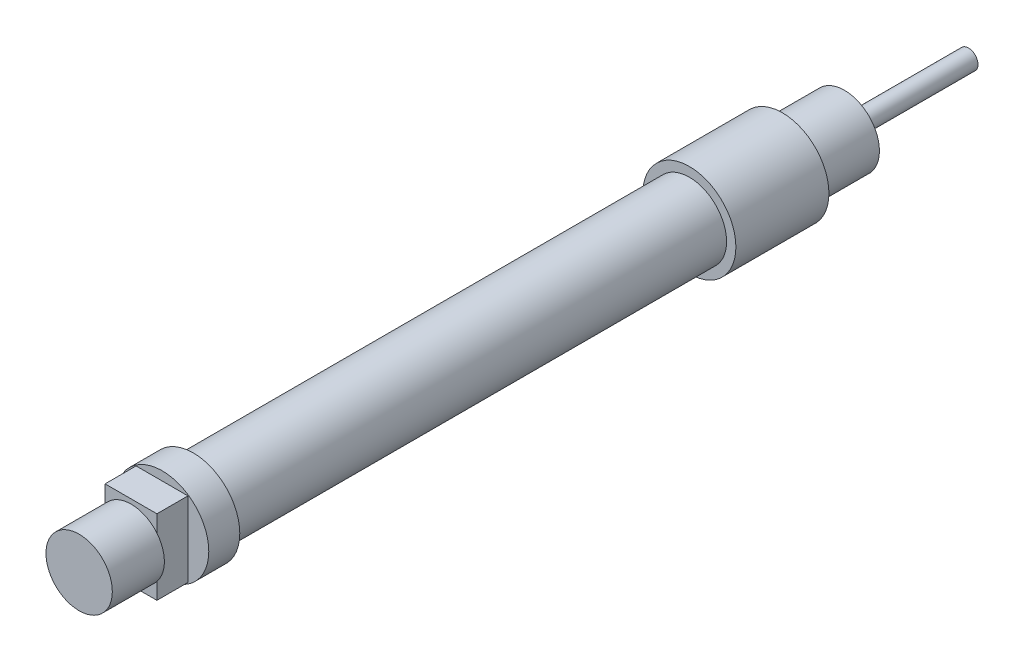
ISO-10303-21;
HEADER;
FILE_DESCRIPTION(('STEP AP214'),'2;1');
FILE_NAME('part.step','',(''),(''),'','','');
FILE_SCHEMA(('AUTOMOTIVE_DESIGN { 1 0 10303 214 1 1 1 1 }'));
ENDSEC;
DATA;
#1=APPLICATION_CONTEXT('core data for automotive mechanical design processes');
#2=APPLICATION_PROTOCOL_DEFINITION('international standard','automotive_design',2000,#1);
#3=PRODUCT_CONTEXT('',#1,'mechanical');
#4=PRODUCT('Part','Part','',(#3));
#5=PRODUCT_RELATED_PRODUCT_CATEGORY('part','',(#4));
#6=PRODUCT_DEFINITION_FORMATION('','',#4);
#7=PRODUCT_DEFINITION_CONTEXT('part definition',#1,'design');
#8=PRODUCT_DEFINITION('design','',#6,#7);
#9=PRODUCT_DEFINITION_SHAPE('','',#8);
#10=(LENGTH_UNIT() NAMED_UNIT(*) SI_UNIT(.MILLI.,.METRE.));
#11=(NAMED_UNIT(*) PLANE_ANGLE_UNIT() SI_UNIT($,.RADIAN.));
#12=(NAMED_UNIT(*) SI_UNIT($,.STERADIAN.) SOLID_ANGLE_UNIT());
#13=UNCERTAINTY_MEASURE_WITH_UNIT(LENGTH_MEASURE(1.E-05),#10,'distance_accuracy_value','');
#14=(GEOMETRIC_REPRESENTATION_CONTEXT(3) GLOBAL_UNCERTAINTY_ASSIGNED_CONTEXT((#13)) GLOBAL_UNIT_ASSIGNED_CONTEXT((#10,
#11,#12)) REPRESENTATION_CONTEXT('',''));
#15=CARTESIAN_POINT('',(0.,0.,0.));
#16=DIRECTION('',(0.,0.,1.));
#17=DIRECTION('',(1.,0.,0.));
#18=AXIS2_PLACEMENT_3D('',#15,#16,#17);
#19=CARTESIAN_POINT('',(-11.6702591087851,4.99038929440389,-10.));
#20=DIRECTION('',(0.,0.,-1.));
#21=DIRECTION('',(-1.,0.,0.));
#22=AXIS2_PLACEMENT_3D('',#19,#20,#21);
#23=PLANE('',#22);
#24=CARTESIAN_POINT('',(-11.6702591087851,4.99038929440389,-10.));
#25=DIRECTION('',(0.,0.,-1.));
#26=DIRECTION('',(-1.,0.,0.));
#27=AXIS2_PLACEMENT_3D('',#24,#25,#26);
#28=CIRCLE('',#27,5.64119912382956);
#29=CARTESIAN_POINT('',(-17.3114582326147,4.99038929440389,-10.));
#30=VERTEX_POINT('',#29);
#31=EDGE_CURVE('E112',#30,#30,#28,.T.);
#32=ORIENTED_EDGE('',*,*,#31,.T.);
#33=EDGE_LOOP('',(#32));
#34=FACE_BOUND('',#33,.T.);
#35=CARTESIAN_POINT('',(-11.6702591087851,4.99038929440389,-10.));
#36=DIRECTION('',(0.,0.,-1.));
#37=DIRECTION('',(-1.,0.,0.));
#38=AXIS2_PLACEMENT_3D('',#35,#36,#37);
#39=CIRCLE('',#38,1.54051339526944);
#40=CARTESIAN_POINT('',(-13.2107725040546,4.99038929440389,-10.));
#41=VERTEX_POINT('',#40);
#42=EDGE_CURVE('E134',#41,#41,#39,.T.);
#43=ORIENTED_EDGE('',*,*,#42,.F.);
#44=EDGE_LOOP('',(#43));
#45=FACE_BOUND('',#44,.T.);
#46=ADVANCED_FACE('F37',(#34,#45),#23,.T.);
#47=CARTESIAN_POINT('',(-11.6702591087851,4.99038929440389,0.));
#48=DIRECTION('',(0.,0.,1.));
#49=DIRECTION('',(1.,0.,0.));
#50=AXIS2_PLACEMENT_3D('',#47,#48,#49);
#51=PLANE('',#50);
#52=CARTESIAN_POINT('',(-11.6702591087851,4.99038929440389,0.));
#53=DIRECTION('',(0.,0.,1.));
#54=DIRECTION('',(1.,0.,0.));
#55=AXIS2_PLACEMENT_3D('',#52,#53,#54);
#56=CIRCLE('',#55,7.5);
#57=CARTESIAN_POINT('',(-4.17025910878514,4.99038929440389,0.));
#58=VERTEX_POINT('',#57);
#59=EDGE_CURVE('E120',#58,#58,#56,.T.);
#60=ORIENTED_EDGE('',*,*,#59,.F.);
#61=EDGE_LOOP('',(#60));
#62=FACE_BOUND('',#61,.T.);
#63=CARTESIAN_POINT('',(-11.6702591087851,4.99038929440389,0.));
#64=DIRECTION('',(0.,0.,1.));
#65=DIRECTION('',(1.,0.,0.));
#66=AXIS2_PLACEMENT_3D('',#63,#64,#65);
#67=CIRCLE('',#66,5.64119912382956);
#68=CARTESIAN_POINT('',(-6.02905998495558,4.99038929440389,0.));
#69=VERTEX_POINT('',#68);
#70=EDGE_CURVE('E11',#69,#69,#67,.F.);
#71=ORIENTED_EDGE('',*,*,#70,.F.);
#72=EDGE_LOOP('',(#71));
#73=FACE_BOUND('',#72,.T.);
#74=ADVANCED_FACE('F150',(#62,#73),#51,.F.);
#75=CARTESIAN_POINT('',(0.,0.,105.));
#76=DIRECTION('',(0.,0.,1.));
#77=DIRECTION('',(1.,0.,0.));
#78=AXIS2_PLACEMENT_3D('',#75,#76,#77);
#79=PLANE('',#78);
#80=CARTESIAN_POINT('',(-11.6702591087851,4.99038929440389,105.));
#81=DIRECTION('',(0.,0.,1.));
#82=DIRECTION('',(1.,0.,0.));
#83=AXIS2_PLACEMENT_3D('',#80,#81,#82);
#84=CIRCLE('',#83,5.35);
#85=CARTESIAN_POINT('',(-7.51876812336915,8.36494446479447,105.));
#86=VERTEX_POINT('',#85);
#87=CARTESIAN_POINT('',(-15.8771447306678,8.29562958285441,105.));
#88=VERTEX_POINT('',#87);
#89=EDGE_CURVE('E114',#86,#88,#84,.T.);
#90=ORIENTED_EDGE('',*,*,#89,.F.);
#91=DIRECTION('',(0.,1.,0.));
#92=VECTOR('',#91,1.);
#93=CARTESIAN_POINT('',(-7.51876812336915,-1.02325652339945,105.));
#94=LINE('',#93,#92);
#95=CARTESIAN_POINT('',(-7.51876812336915,11.0668397408952,105.));
#96=VERTEX_POINT('',#95);
#97=EDGE_CURVE('E99',#86,#96,#94,.T.);
#98=ORIENTED_EDGE('',*,*,#97,.T.);
#99=DIRECTION('',(-1.,0.,0.));
#100=VECTOR('',#99,1.);
#101=CARTESIAN_POINT('',(-7.51876812336915,11.0668397408952,105.));
#102=LINE('',#101,#100);
#103=CARTESIAN_POINT('',(-15.8771447306679,11.0668397408952,105.));
#104=VERTEX_POINT('',#103);
#105=EDGE_CURVE('E96',#96,#104,#102,.T.);
#106=ORIENTED_EDGE('',*,*,#105,.T.);
#107=DIRECTION('',(0.,-1.,0.));
#108=VECTOR('',#107,1.);
#109=CARTESIAN_POINT('',(-15.8771447306679,11.0668397408952,105.));
#110=LINE('',#109,#108);
#111=EDGE_CURVE('E250',#104,#88,#110,.T.);
#112=ORIENTED_EDGE('',*,*,#111,.T.);
#113=EDGE_LOOP('',(#90,#98,#106,#112));
#114=FACE_BOUND('',#113,.T.);
#115=ADVANCED_FACE('F156',(#114),#79,.T.);
#116=CARTESIAN_POINT('',(-11.6581113080212,5.00253709516818,100.));
#117=DIRECTION('',(0.,0.,1.));
#118=DIRECTION('',(1.,0.,0.));
#119=AXIS2_PLACEMENT_3D('',#116,#117,#118);
#120=PLANE('',#119);
#121=CARTESIAN_POINT('',(-11.6581113080212,5.00253709516818,100.));
#122=DIRECTION('',(0.,0.,1.));
#123=DIRECTION('',(1.,0.,0.));
#124=AXIS2_PLACEMENT_3D('',#121,#122,#123);
#125=CIRCLE('',#124,7.5);
#126=CARTESIAN_POINT('',(-4.15811130802117,5.00253709516818,100.));
#127=VERTEX_POINT('',#126);
#128=EDGE_CURVE('E217',#127,#127,#125,.T.);
#129=ORIENTED_EDGE('',*,*,#128,.T.);
#130=EDGE_LOOP('',(#129));
#131=FACE_BOUND('',#130,.T.);
#132=DIRECTION('',(-1.,0.,0.));
#133=VECTOR('',#132,1.);
#134=CARTESIAN_POINT('',(-7.51876812336915,11.0668397408952,100.));
#135=LINE('',#134,#133);
#136=CARTESIAN_POINT('',(-7.51876812336915,11.0668397408952,100.));
#137=VERTEX_POINT('',#136);
#138=CARTESIAN_POINT('',(-15.8771447306679,11.0668397408952,100.));
#139=VERTEX_POINT('',#138);
#140=EDGE_CURVE('E128',#137,#139,#135,.T.);
#141=ORIENTED_EDGE('',*,*,#140,.F.);
#142=DIRECTION('',(0.,1.,0.));
#143=VECTOR('',#142,1.);
#144=CARTESIAN_POINT('',(-7.51876812336915,4.99038929440389,100.));
#145=LINE('',#144,#143);
#146=CARTESIAN_POINT('',(-7.51876812336915,-1.02325652339945,100.));
#147=VERTEX_POINT('',#146);
#148=EDGE_CURVE('E125',#147,#137,#145,.T.);
#149=ORIENTED_EDGE('',*,*,#148,.F.);
#150=DIRECTION('',(1.,0.,0.));
#151=VECTOR('',#150,1.);
#152=CARTESIAN_POINT('',(-15.8771447306679,-1.02325652339945,100.));
#153=LINE('',#152,#151);
#154=CARTESIAN_POINT('',(-15.8771447306679,-1.02325652339945,100.));
#155=VERTEX_POINT('',#154);
#156=EDGE_CURVE('E243',#155,#147,#153,.T.);
#157=ORIENTED_EDGE('',*,*,#156,.F.);
#158=DIRECTION('',(0.,-1.,0.));
#159=VECTOR('',#158,1.);
#160=CARTESIAN_POINT('',(-15.8771447306679,11.0668397408952,100.));
#161=LINE('',#160,#159);
#162=EDGE_CURVE('E245',#139,#155,#161,.T.);
#163=ORIENTED_EDGE('',*,*,#162,.F.);
#164=EDGE_LOOP('',(#141,#149,#157,#163));
#165=FACE_BOUND('',#164,.T.);
#166=ADVANCED_FACE('F188',(#131,#165),#120,.T.);
#167=CARTESIAN_POINT('',(-11.6702591087851,4.99038929440389,15.));
#168=DIRECTION('',(0.,0.,1.));
#169=DIRECTION('',(1.,0.,0.));
#170=AXIS2_PLACEMENT_3D('',#167,#168,#169);
#171=PLANE('',#170);
#172=CARTESIAN_POINT('',(-11.6702591087851,4.99038929440389,15.));
#173=DIRECTION('',(0.,0.,1.));
#174=DIRECTION('',(1.,0.,0.));
#175=AXIS2_PLACEMENT_3D('',#172,#173,#174);
#176=CIRCLE('',#175,7.5);
#177=CARTESIAN_POINT('',(-4.17025910878514,4.99038929440389,15.));
#178=VERTEX_POINT('',#177);
#179=EDGE_CURVE('E118',#178,#178,#176,.T.);
#180=ORIENTED_EDGE('',*,*,#179,.T.);
#181=EDGE_LOOP('',(#180));
#182=FACE_BOUND('',#181,.T.);
#183=CARTESIAN_POINT('',(-11.6702591087851,4.99038929440389,15.));
#184=DIRECTION('',(0.,0.,1.));
#185=DIRECTION('',(1.,0.,0.));
#186=AXIS2_PLACEMENT_3D('',#183,#184,#185);
#187=CIRCLE('',#186,6.);
#188=CARTESIAN_POINT('',(-5.67025910878514,4.99038929440389,15.));
#189=VERTEX_POINT('',#188);
#190=EDGE_CURVE('E214',#189,#189,#187,.T.);
#191=ORIENTED_EDGE('',*,*,#190,.F.);
#192=EDGE_LOOP('',(#191));
#193=FACE_BOUND('',#192,.T.);
#194=ADVANCED_FACE('F191',(#182,#193),#171,.T.);
#195=CARTESIAN_POINT('',(-11.6702591087851,4.99038929440389,15.));
#196=DIRECTION('',(0.,0.,-1.));
#197=DIRECTION('',(-1.,0.,0.));
#198=AXIS2_PLACEMENT_3D('',#195,#196,#197);
#199=CYLINDRICAL_SURFACE('',#198,7.5);
#200=ORIENTED_EDGE('',*,*,#179,.F.);
#201=EDGE_LOOP('',(#200));
#202=FACE_BOUND('',#201,.T.);
#203=ORIENTED_EDGE('',*,*,#59,.T.);
#204=EDGE_LOOP('',(#203));
#205=FACE_BOUND('',#204,.T.);
#206=ADVANCED_FACE('F39',(#202,#205),#199,.T.);
#207=CARTESIAN_POINT('',(-11.6702591087851,4.99038929440389,95.));
#208=DIRECTION('',(0.,0.,-1.));
#209=DIRECTION('',(-1.,0.,0.));
#210=AXIS2_PLACEMENT_3D('',#207,#208,#209);
#211=CYLINDRICAL_SURFACE('',#210,6.);
#212=CARTESIAN_POINT('',(-11.6702591087851,4.99038929440389,95.));
#213=DIRECTION('',(0.,0.,1.));
#214=DIRECTION('',(1.,0.,0.));
#215=AXIS2_PLACEMENT_3D('',#212,#213,#214);
#216=CIRCLE('',#215,6.);
#217=CARTESIAN_POINT('',(-5.67025910878514,4.99038929440389,95.));
#218=VERTEX_POINT('',#217);
#219=EDGE_CURVE('E216',#218,#218,#216,.T.);
#220=ORIENTED_EDGE('',*,*,#219,.F.);
#221=EDGE_LOOP('',(#220));
#222=FACE_BOUND('',#221,.T.);
#223=ORIENTED_EDGE('',*,*,#190,.T.);
#224=EDGE_LOOP('',(#223));
#225=FACE_BOUND('',#224,.T.);
#226=ADVANCED_FACE('F196',(#222,#225),#211,.T.);
#227=CARTESIAN_POINT('',(-11.6581113080212,5.00253709516818,95.));
#228=DIRECTION('',(0.,0.,1.));
#229=DIRECTION('',(1.,0.,0.));
#230=AXIS2_PLACEMENT_3D('',#227,#228,#229);
#231=PLANE('',#230);
#232=CARTESIAN_POINT('',(-11.6581113080212,5.00253709516818,95.));
#233=DIRECTION('',(0.,0.,1.));
#234=DIRECTION('',(1.,0.,0.));
#235=AXIS2_PLACEMENT_3D('',#232,#233,#234);
#236=CIRCLE('',#235,7.5);
#237=CARTESIAN_POINT('',(-4.15811130802117,5.00253709516818,95.));
#238=VERTEX_POINT('',#237);
#239=EDGE_CURVE('E222',#238,#238,#236,.T.);
#240=ORIENTED_EDGE('',*,*,#239,.F.);
#241=EDGE_LOOP('',(#240));
#242=FACE_BOUND('',#241,.T.);
#243=ORIENTED_EDGE('',*,*,#219,.T.);
#244=EDGE_LOOP('',(#243));
#245=FACE_BOUND('',#244,.T.);
#246=ADVANCED_FACE('F193',(#242,#245),#231,.F.);
#247=CARTESIAN_POINT('',(-11.6581113080212,5.00253709516818,100.));
#248=DIRECTION('',(0.,0.,-1.));
#249=DIRECTION('',(-1.,0.,0.));
#250=AXIS2_PLACEMENT_3D('',#247,#248,#249);
#251=CYLINDRICAL_SURFACE('',#250,7.5);
#252=ORIENTED_EDGE('',*,*,#128,.F.);
#253=EDGE_LOOP('',(#252));
#254=FACE_BOUND('',#253,.T.);
#255=ORIENTED_EDGE('',*,*,#239,.T.);
#256=EDGE_LOOP('',(#255));
#257=FACE_BOUND('',#256,.T.);
#258=ADVANCED_FACE('F187',(#254,#257),#251,.T.);
#259=CARTESIAN_POINT('',(-7.51876812336915,4.99038929440389,105.));
#260=DIRECTION('',(-1.,0.,0.));
#261=DIRECTION('',(0.,0.,1.));
#262=AXIS2_PLACEMENT_3D('',#259,#260,#261);
#263=PLANE('',#262);
#264=ORIENTED_EDGE('',*,*,#148,.T.);
#265=DIRECTION('',(0.,0.,-1.));
#266=VECTOR('',#265,1.);
#267=CARTESIAN_POINT('',(-7.51876812336915,11.0668397408952,105.));
#268=LINE('',#267,#266);
#269=EDGE_CURVE('E232',#96,#137,#268,.T.);
#270=ORIENTED_EDGE('',*,*,#269,.F.);
#271=ORIENTED_EDGE('',*,*,#97,.F.);
#272=CARTESIAN_POINT('',(-7.51876812336915,1.61583412401331,105.));
#273=VERTEX_POINT('',#272);
#274=EDGE_CURVE('E97',#273,#86,#94,.T.);
#275=ORIENTED_EDGE('',*,*,#274,.F.);
#276=CARTESIAN_POINT('',(-7.51876812336915,-1.02325652339945,105.));
#277=VERTEX_POINT('',#276);
#278=EDGE_CURVE('E88',#277,#273,#94,.T.);
#279=ORIENTED_EDGE('',*,*,#278,.F.);
#280=DIRECTION('',(0.,0.,-1.));
#281=VECTOR('',#280,1.);
#282=CARTESIAN_POINT('',(-7.51876812336915,-1.02325652339945,105.));
#283=LINE('',#282,#281);
#284=EDGE_CURVE('E241',#277,#147,#283,.T.);
#285=ORIENTED_EDGE('',*,*,#284,.T.);
#286=EDGE_LOOP('',(#264,#270,#271,#275,#279,#285));
#287=FACE_BOUND('',#286,.T.);
#288=ADVANCED_FACE('F103',(#287),#263,.F.);
#289=CARTESIAN_POINT('',(-7.51876812336915,11.0668397408952,105.));
#290=DIRECTION('',(0.,-1.,0.));
#291=DIRECTION('',(0.,0.,-1.));
#292=AXIS2_PLACEMENT_3D('',#289,#290,#291);
#293=PLANE('',#292);
#294=ORIENTED_EDGE('',*,*,#140,.T.);
#295=DIRECTION('',(0.,0.,-1.));
#296=VECTOR('',#295,1.);
#297=CARTESIAN_POINT('',(-15.8771447306679,11.0668397408952,105.));
#298=LINE('',#297,#296);
#299=EDGE_CURVE('E236',#104,#139,#298,.T.);
#300=ORIENTED_EDGE('',*,*,#299,.F.);
#301=ORIENTED_EDGE('',*,*,#105,.F.);
#302=ORIENTED_EDGE('',*,*,#269,.T.);
#303=EDGE_LOOP('',(#294,#300,#301,#302));
#304=FACE_BOUND('',#303,.T.);
#305=ADVANCED_FACE('F181',(#304),#293,.F.);
#306=CARTESIAN_POINT('',(-15.8771447306679,11.0668397408952,105.));
#307=DIRECTION('',(1.,0.,0.));
#308=DIRECTION('',(0.,0.,-1.));
#309=AXIS2_PLACEMENT_3D('',#306,#307,#308);
#310=PLANE('',#309);
#311=ORIENTED_EDGE('',*,*,#162,.T.);
#312=DIRECTION('',(0.,0.,-1.));
#313=VECTOR('',#312,1.);
#314=CARTESIAN_POINT('',(-15.8771447306679,-1.02325652339945,105.));
#315=LINE('',#314,#313);
#316=CARTESIAN_POINT('',(-15.8771447306679,-1.02325652339945,105.));
#317=VERTEX_POINT('',#316);
#318=EDGE_CURVE('E239',#317,#155,#315,.T.);
#319=ORIENTED_EDGE('',*,*,#318,.F.);
#320=CARTESIAN_POINT('',(-15.8771447306678,1.68514900595337,105.));
#321=VERTEX_POINT('',#320);
#322=EDGE_CURVE('E252',#321,#317,#110,.T.);
#323=ORIENTED_EDGE('',*,*,#322,.F.);
#324=EDGE_CURVE('E58',#88,#321,#110,.T.);
#325=ORIENTED_EDGE('',*,*,#324,.F.);
#326=ORIENTED_EDGE('',*,*,#111,.F.);
#327=ORIENTED_EDGE('',*,*,#299,.T.);
#328=EDGE_LOOP('',(#311,#319,#323,#325,#326,#327));
#329=FACE_BOUND('',#328,.T.);
#330=ADVANCED_FACE('F177',(#329),#310,.F.);
#331=CARTESIAN_POINT('',(-15.8771447306679,-1.02325652339945,105.));
#332=DIRECTION('',(0.,1.,0.));
#333=DIRECTION('',(0.,0.,1.));
#334=AXIS2_PLACEMENT_3D('',#331,#332,#333);
#335=PLANE('',#334);
#336=ORIENTED_EDGE('',*,*,#156,.T.);
#337=ORIENTED_EDGE('',*,*,#284,.F.);
#338=DIRECTION('',(1.,0.,0.));
#339=VECTOR('',#338,1.);
#340=CARTESIAN_POINT('',(-15.8771447306679,-1.02325652339945,105.));
#341=LINE('',#340,#339);
#342=EDGE_CURVE('E92',#317,#277,#341,.T.);
#343=ORIENTED_EDGE('',*,*,#342,.F.);
#344=ORIENTED_EDGE('',*,*,#318,.T.);
#345=EDGE_LOOP('',(#336,#337,#343,#344));
#346=FACE_BOUND('',#345,.T.);
#347=ADVANCED_FACE('F174',(#346),#335,.F.);
#348=EDGE_CURVE('E45',#321,#273,#84,.T.);
#349=ORIENTED_EDGE('',*,*,#348,.F.);
#350=ORIENTED_EDGE('',*,*,#322,.T.);
#351=ORIENTED_EDGE('',*,*,#342,.T.);
#352=ORIENTED_EDGE('',*,*,#278,.T.);
#353=EDGE_LOOP('',(#349,#350,#351,#352));
#354=FACE_BOUND('',#353,.T.);
#355=ADVANCED_FACE('F90',(#354),#79,.T.);
#356=CARTESIAN_POINT('',(-11.6702591087851,4.99038929440389,105.));
#357=DIRECTION('',(0.,0.,1.));
#358=DIRECTION('',(1.,0.,0.));
#359=AXIS2_PLACEMENT_3D('',#356,#357,#358);
#360=PLANE('',#359);
#361=EDGE_CURVE('E107',#273,#86,#84,.T.);
#362=ORIENTED_EDGE('',*,*,#361,.F.);
#363=ORIENTED_EDGE('',*,*,#274,.T.);
#364=EDGE_LOOP('',(#362,#363));
#365=FACE_BOUND('',#364,.T.);
#366=ADVANCED_FACE('F108',(#365),#360,.F.);
#367=EDGE_CURVE('E111',#88,#321,#84,.T.);
#368=ORIENTED_EDGE('',*,*,#367,.F.);
#369=ORIENTED_EDGE('',*,*,#324,.T.);
#370=EDGE_LOOP('',(#368,#369));
#371=FACE_BOUND('',#370,.T.);
#372=ADVANCED_FACE('F168',(#371),#360,.F.);
#373=CARTESIAN_POINT('',(-11.6702591087851,4.99038929440389,113.39));
#374=DIRECTION('',(0.,0.,-1.));
#375=DIRECTION('',(-1.,0.,0.));
#376=AXIS2_PLACEMENT_3D('',#373,#374,#375);
#377=CYLINDRICAL_SURFACE('',#376,5.35);
#378=CARTESIAN_POINT('',(-11.6702591087851,4.99038929440389,113.39));
#379=DIRECTION('',(0.,0.,1.));
#380=DIRECTION('',(1.,0.,0.));
#381=AXIS2_PLACEMENT_3D('',#378,#379,#380);
#382=CIRCLE('',#381,5.35);
#383=CARTESIAN_POINT('',(-6.32025910878513,4.99038929440389,113.39));
#384=VERTEX_POINT('',#383);
#385=EDGE_CURVE('E123',#384,#384,#382,.T.);
#386=ORIENTED_EDGE('',*,*,#385,.F.);
#387=EDGE_LOOP('',(#386));
#388=FACE_BOUND('',#387,.T.);
#389=ORIENTED_EDGE('',*,*,#89,.T.);
#390=ORIENTED_EDGE('',*,*,#367,.T.);
#391=ORIENTED_EDGE('',*,*,#348,.T.);
#392=ORIENTED_EDGE('',*,*,#361,.T.);
#393=EDGE_LOOP('',(#389,#390,#391,#392));
#394=FACE_BOUND('',#393,.T.);
#395=ADVANCED_FACE('F116',(#388,#394),#377,.T.);
#396=CARTESIAN_POINT('',(-11.6702591087851,4.99038929440389,113.39));
#397=DIRECTION('',(0.,0.,1.));
#398=DIRECTION('',(1.,0.,0.));
#399=AXIS2_PLACEMENT_3D('',#396,#397,#398);
#400=PLANE('',#399);
#401=ORIENTED_EDGE('',*,*,#385,.T.);
#402=EDGE_LOOP('',(#401));
#403=FACE_BOUND('',#402,.T.);
#404=ADVANCED_FACE('F162',(#403),#400,.T.);
#405=CARTESIAN_POINT('',(-11.6702591087851,4.99038929440389,-10.));
#406=DIRECTION('',(0.,0.,1.));
#407=DIRECTION('',(1.,0.,0.));
#408=AXIS2_PLACEMENT_3D('',#405,#406,#407);
#409=CYLINDRICAL_SURFACE('',#408,5.64119912382956);
#410=ORIENTED_EDGE('',*,*,#31,.F.);
#411=EDGE_LOOP('',(#410));
#412=FACE_BOUND('',#411,.T.);
#413=ORIENTED_EDGE('',*,*,#70,.T.);
#414=EDGE_LOOP('',(#413));
#415=FACE_BOUND('',#414,.T.);
#416=ADVANCED_FACE('F145',(#412,#415),#409,.T.);
#417=CARTESIAN_POINT('',(-11.6702591087851,4.99038929440389,-30.));
#418=DIRECTION('',(0.,0.,1.));
#419=DIRECTION('',(1.,0.,0.));
#420=AXIS2_PLACEMENT_3D('',#417,#418,#419);
#421=CYLINDRICAL_SURFACE('',#420,1.54051339526944);
#422=CARTESIAN_POINT('',(-11.6702591087851,4.99038929440389,-30.));
#423=DIRECTION('',(0.,0.,-1.));
#424=DIRECTION('',(-1.,0.,0.));
#425=AXIS2_PLACEMENT_3D('',#422,#423,#424);
#426=CIRCLE('',#425,1.54051339526944);
#427=CARTESIAN_POINT('',(-13.2107725040546,4.99038929440389,-30.));
#428=VERTEX_POINT('',#427);
#429=EDGE_CURVE('E133',#428,#428,#426,.T.);
#430=ORIENTED_EDGE('',*,*,#429,.F.);
#431=EDGE_LOOP('',(#430));
#432=FACE_BOUND('',#431,.T.);
#433=ORIENTED_EDGE('',*,*,#42,.T.);
#434=EDGE_LOOP('',(#433));
#435=FACE_BOUND('',#434,.T.);
#436=ADVANCED_FACE('F142',(#432,#435),#421,.T.);
#437=CARTESIAN_POINT('',(-11.6702591087851,4.99038929440389,-30.));
#438=DIRECTION('',(0.,0.,-1.));
#439=DIRECTION('',(-1.,0.,0.));
#440=AXIS2_PLACEMENT_3D('',#437,#438,#439);
#441=PLANE('',#440);
#442=ORIENTED_EDGE('',*,*,#429,.T.);
#443=EDGE_LOOP('',(#442));
#444=FACE_BOUND('',#443,.T.);
#445=ADVANCED_FACE('F140',(#444),#441,.T.);
#446=CLOSED_SHELL('',(#46,#74,#115,#166,#194,#206,#226,#246,#258,#288,#305,#330,#347,#355,#366,
#372,#395,#404,#416,#436,#445));
#447=MANIFOLD_SOLID_BREP('B2',#446);
#448=ADVANCED_BREP_SHAPE_REPRESENTATION('',(#18,#447),#14);
#449=SHAPE_DEFINITION_REPRESENTATION(#9,#448);
ENDSEC;
END-ISO-10303-21;
